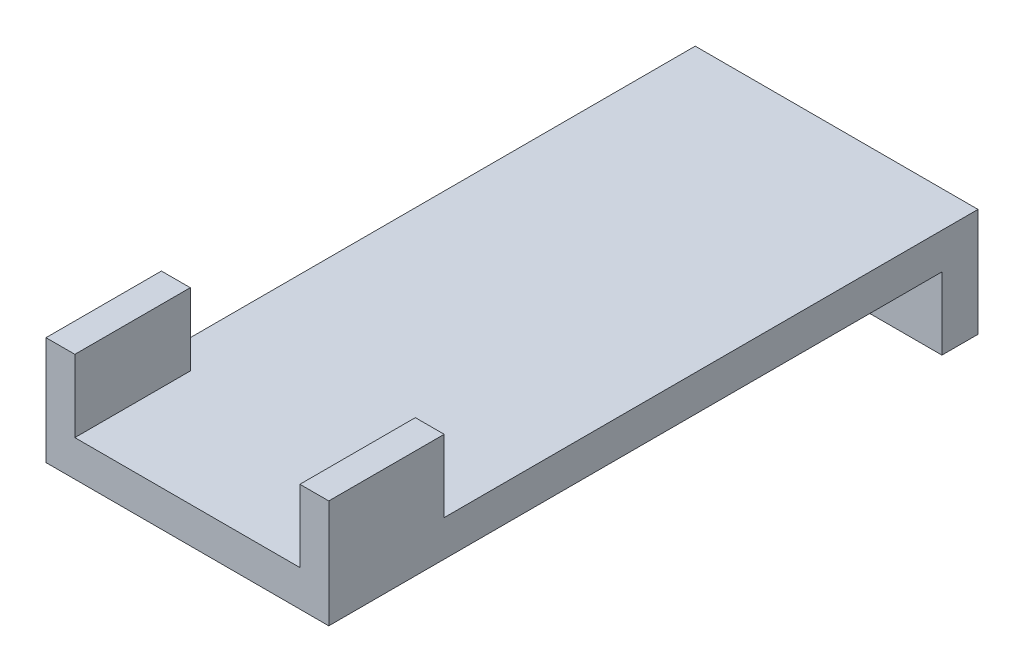
ISO-10303-21;
HEADER;
FILE_DESCRIPTION(('STEP AP214'),'2;1');
FILE_NAME('part.step','',(''),(''),'','','');
FILE_SCHEMA(('AUTOMOTIVE_DESIGN { 1 0 10303 214 1 1 1 1 }'));
ENDSEC;
DATA;
#1=APPLICATION_CONTEXT('core data for automotive mechanical design processes');
#2=APPLICATION_PROTOCOL_DEFINITION('international standard','automotive_design',2000,#1);
#3=PRODUCT_CONTEXT('',#1,'mechanical');
#4=PRODUCT('Part','Part','',(#3));
#5=PRODUCT_RELATED_PRODUCT_CATEGORY('part','',(#4));
#6=PRODUCT_DEFINITION_FORMATION('','',#4);
#7=PRODUCT_DEFINITION_CONTEXT('part definition',#1,'design');
#8=PRODUCT_DEFINITION('design','',#6,#7);
#9=PRODUCT_DEFINITION_SHAPE('','',#8);
#10=(LENGTH_UNIT() NAMED_UNIT(*) SI_UNIT(.MILLI.,.METRE.));
#11=(NAMED_UNIT(*) PLANE_ANGLE_UNIT() SI_UNIT($,.RADIAN.));
#12=(NAMED_UNIT(*) SI_UNIT($,.STERADIAN.) SOLID_ANGLE_UNIT());
#13=UNCERTAINTY_MEASURE_WITH_UNIT(LENGTH_MEASURE(1.E-05),#10,'distance_accuracy_value','');
#14=(GEOMETRIC_REPRESENTATION_CONTEXT(3) GLOBAL_UNCERTAINTY_ASSIGNED_CONTEXT((#13)) GLOBAL_UNIT_ASSIGNED_CONTEXT((#10,
#11,#12)) REPRESENTATION_CONTEXT('',''));
#15=CARTESIAN_POINT('',(0.,0.,0.));
#16=DIRECTION('',(0.,0.,1.));
#17=DIRECTION('',(1.,0.,0.));
#18=AXIS2_PLACEMENT_3D('',#15,#16,#17);
#19=CARTESIAN_POINT('',(0.,3.20985201149425,0.0218600574712643));
#20=DIRECTION('',(0.,-1.,0.));
#21=DIRECTION('',(0.,0.,-1.));
#22=AXIS2_PLACEMENT_3D('',#19,#20,#21);
#23=PLANE('',#22);
#24=DIRECTION('',(0.,0.,-1.));
#25=VECTOR('',#24,1.);
#26=CARTESIAN_POINT('',(-10.10412,3.20985201149425,29.1683600574713));
#27=LINE('',#26,#25);
#28=CARTESIAN_POINT('',(-10.10412,3.20985201149425,29.1683600574713));
#29=VERTEX_POINT('',#28);
#30=CARTESIAN_POINT('',(-10.10412,3.20985201149425,18.8051600574713));
#31=VERTEX_POINT('',#30);
#32=EDGE_CURVE('E149',#29,#31,#27,.T.);
#33=ORIENTED_EDGE('',*,*,#32,.F.);
#34=DIRECTION('',(1.,0.,0.));
#35=VECTOR('',#34,1.);
#36=CARTESIAN_POINT('',(-12.69492,3.20985201149425,29.1683600574713));
#37=LINE('',#36,#35);
#38=CARTESIAN_POINT('',(10.10412,3.20985201149425,29.1683600574713));
#39=VERTEX_POINT('',#38);
#40=EDGE_CURVE('E206',#29,#39,#37,.T.);
#41=ORIENTED_EDGE('',*,*,#40,.T.);
#42=DIRECTION('',(0.,0.,1.));
#43=VECTOR('',#42,1.);
#44=CARTESIAN_POINT('',(10.10412,3.20985201149425,29.1683600574713));
#45=LINE('',#44,#43);
#46=CARTESIAN_POINT('',(10.10412,3.20985201149425,18.8051600574713));
#47=VERTEX_POINT('',#46);
#48=EDGE_CURVE('E179',#47,#39,#45,.T.);
#49=ORIENTED_EDGE('',*,*,#48,.F.);
#50=DIRECTION('',(-1.,0.,0.));
#51=VECTOR('',#50,1.);
#52=CARTESIAN_POINT('',(12.69492,3.20985201149425,18.8051600574713));
#53=LINE('',#52,#51);
#54=CARTESIAN_POINT('',(12.69492,3.20985201149425,18.8051600574713));
#55=VERTEX_POINT('',#54);
#56=EDGE_CURVE('E174',#55,#47,#53,.T.);
#57=ORIENTED_EDGE('',*,*,#56,.F.);
#58=DIRECTION('',(0.,0.,-1.));
#59=VECTOR('',#58,1.);
#60=CARTESIAN_POINT('',(12.69492,3.20985201149425,29.1683600574713));
#61=LINE('',#60,#59);
#62=CARTESIAN_POINT('',(12.69492,3.20985201149425,-29.1246399425287));
#63=VERTEX_POINT('',#62);
#64=EDGE_CURVE('E199',#55,#63,#61,.T.);
#65=ORIENTED_EDGE('',*,*,#64,.T.);
#66=DIRECTION('',(-1.,0.,0.));
#67=VECTOR('',#66,1.);
#68=CARTESIAN_POINT('',(-12.69492,3.20985201149425,-29.1246399425287));
#69=LINE('',#68,#67);
#70=CARTESIAN_POINT('',(-12.69492,3.20985201149425,-29.1246399425287));
#71=VERTEX_POINT('',#70);
#72=EDGE_CURVE('E201',#63,#71,#69,.T.);
#73=ORIENTED_EDGE('',*,*,#72,.T.);
#74=DIRECTION('',(0.,0.,1.));
#75=VECTOR('',#74,1.);
#76=CARTESIAN_POINT('',(-12.69492,3.20985201149425,29.1683600574713));
#77=LINE('',#76,#75);
#78=CARTESIAN_POINT('',(-12.69492,3.20985201149425,18.8051600574713));
#79=VERTEX_POINT('',#78);
#80=EDGE_CURVE('E204',#71,#79,#77,.T.);
#81=ORIENTED_EDGE('',*,*,#80,.T.);
#82=DIRECTION('',(-1.,0.,0.));
#83=VECTOR('',#82,1.);
#84=CARTESIAN_POINT('',(-12.69492,3.20985201149425,18.8051600574713));
#85=LINE('',#84,#83);
#86=EDGE_CURVE('E59',#31,#79,#85,.T.);
#87=ORIENTED_EDGE('',*,*,#86,.F.);
#88=EDGE_LOOP('',(#33,#41,#49,#57,#65,#73,#81,#87));
#89=FACE_BOUND('',#88,.T.);
#90=ADVANCED_FACE('F36',(#89),#23,.F.);
#91=CARTESIAN_POINT('',(12.69492,3.20985201149425,29.1683600574713));
#92=DIRECTION('',(-1.,0.,0.));
#93=DIRECTION('',(0.,0.,1.));
#94=AXIS2_PLACEMENT_3D('',#91,#92,#93);
#95=PLANE('',#94);
#96=DIRECTION('',(0.,0.,-1.));
#97=VECTOR('',#96,1.);
#98=CARTESIAN_POINT('',(12.69492,-0.0286479885057471,29.1683600574713));
#99=LINE('',#98,#97);
#100=CARTESIAN_POINT('',(12.69492,-0.0286479885057471,29.1683600574713));
#101=VERTEX_POINT('',#100);
#102=CARTESIAN_POINT('',(12.69492,-0.0286479885057471,-25.8861399425287));
#103=VERTEX_POINT('',#102);
#104=EDGE_CURVE('E148',#101,#103,#99,.T.);
#105=ORIENTED_EDGE('',*,*,#104,.T.);
#106=DIRECTION('',(0.,1.,0.));
#107=VECTOR('',#106,1.);
#108=CARTESIAN_POINT('',(12.69492,-6.50564798850575,-25.8861399425287));
#109=LINE('',#108,#107);
#110=CARTESIAN_POINT('',(12.69492,-6.50564798850575,-25.8861399425287));
#111=VERTEX_POINT('',#110);
#112=EDGE_CURVE('E130',#111,#103,#109,.T.);
#113=ORIENTED_EDGE('',*,*,#112,.F.);
#114=DIRECTION('',(0.,0.,1.));
#115=VECTOR('',#114,1.);
#116=CARTESIAN_POINT('',(12.69492,-6.50564798850575,-29.1246399425287));
#117=LINE('',#116,#115);
#118=CARTESIAN_POINT('',(12.69492,-6.50564798850575,-29.1246399425287));
#119=VERTEX_POINT('',#118);
#120=EDGE_CURVE('E137',#119,#111,#117,.T.);
#121=ORIENTED_EDGE('',*,*,#120,.F.);
#122=DIRECTION('',(0.,-1.,0.));
#123=VECTOR('',#122,1.);
#124=CARTESIAN_POINT('',(12.69492,3.20985201149425,-29.1246399425287));
#125=LINE('',#124,#123);
#126=EDGE_CURVE('E11',#63,#119,#125,.T.);
#127=ORIENTED_EDGE('',*,*,#126,.F.);
#128=ORIENTED_EDGE('',*,*,#64,.F.);
#129=DIRECTION('',(0.,-1.,0.));
#130=VECTOR('',#129,1.);
#131=CARTESIAN_POINT('',(12.69492,9.68685201149425,18.8051600574713));
#132=LINE('',#131,#130);
#133=CARTESIAN_POINT('',(12.69492,9.68685201149425,18.8051600574713));
#134=VERTEX_POINT('',#133);
#135=EDGE_CURVE('E196',#134,#55,#132,.T.);
#136=ORIENTED_EDGE('',*,*,#135,.F.);
#137=DIRECTION('',(0.,0.,-1.));
#138=VECTOR('',#137,1.);
#139=CARTESIAN_POINT('',(12.69492,9.68685201149425,29.1683600574713));
#140=LINE('',#139,#138);
#141=CARTESIAN_POINT('',(12.69492,9.68685201149425,29.1683600574713));
#142=VERTEX_POINT('',#141);
#143=EDGE_CURVE('E175',#142,#134,#140,.T.);
#144=ORIENTED_EDGE('',*,*,#143,.F.);
#145=DIRECTION('',(0.,-1.,0.));
#146=VECTOR('',#145,1.);
#147=CARTESIAN_POINT('',(12.69492,3.20985201149425,29.1683600574713));
#148=LINE('',#147,#146);
#149=EDGE_CURVE('E208',#142,#101,#148,.T.);
#150=ORIENTED_EDGE('',*,*,#149,.T.);
#151=EDGE_LOOP('',(#105,#113,#121,#127,#128,#136,#144,#150));
#152=FACE_BOUND('',#151,.T.);
#153=ADVANCED_FACE('F38',(#152),#95,.F.);
#154=CARTESIAN_POINT('',(-12.69492,3.20985201149425,-29.1246399425287));
#155=DIRECTION('',(0.,0.,1.));
#156=DIRECTION('',(1.,0.,0.));
#157=AXIS2_PLACEMENT_3D('',#154,#155,#156);
#158=PLANE('',#157);
#159=ORIENTED_EDGE('',*,*,#126,.T.);
#160=DIRECTION('',(1.,0.,0.));
#161=VECTOR('',#160,1.);
#162=CARTESIAN_POINT('',(12.69492,-6.50564798850575,-29.1246399425287));
#163=LINE('',#162,#161);
#164=CARTESIAN_POINT('',(-12.69492,-6.50564798850575,-29.1246399425287));
#165=VERTEX_POINT('',#164);
#166=EDGE_CURVE('E143',#165,#119,#163,.T.);
#167=ORIENTED_EDGE('',*,*,#166,.F.);
#168=DIRECTION('',(0.,-1.,0.));
#169=VECTOR('',#168,1.);
#170=CARTESIAN_POINT('',(-12.69492,3.20985201149425,-29.1246399425287));
#171=LINE('',#170,#169);
#172=EDGE_CURVE('E44',#71,#165,#171,.T.);
#173=ORIENTED_EDGE('',*,*,#172,.F.);
#174=ORIENTED_EDGE('',*,*,#72,.F.);
#175=EDGE_LOOP('',(#159,#167,#173,#174));
#176=FACE_BOUND('',#175,.T.);
#177=ADVANCED_FACE('F223',(#176),#158,.F.);
#178=CARTESIAN_POINT('',(-12.69492,3.20985201149425,29.1683600574713));
#179=DIRECTION('',(1.,0.,0.));
#180=DIRECTION('',(0.,0.,-1.));
#181=AXIS2_PLACEMENT_3D('',#178,#179,#180);
#182=PLANE('',#181);
#183=ORIENTED_EDGE('',*,*,#172,.T.);
#184=DIRECTION('',(0.,0.,-1.));
#185=VECTOR('',#184,1.);
#186=CARTESIAN_POINT('',(-12.69492,-6.50564798850575,-29.1246399425287));
#187=LINE('',#186,#185);
#188=CARTESIAN_POINT('',(-12.69492,-6.50564798850575,-25.8861399425287));
#189=VERTEX_POINT('',#188);
#190=EDGE_CURVE('E136',#189,#165,#187,.T.);
#191=ORIENTED_EDGE('',*,*,#190,.F.);
#192=DIRECTION('',(0.,1.,0.));
#193=VECTOR('',#192,1.);
#194=CARTESIAN_POINT('',(-12.69492,-6.50564798850575,-25.8861399425287));
#195=LINE('',#194,#193);
#196=CARTESIAN_POINT('',(-12.69492,-0.0286479885057471,-25.8861399425287));
#197=VERTEX_POINT('',#196);
#198=EDGE_CURVE('E132',#189,#197,#195,.T.);
#199=ORIENTED_EDGE('',*,*,#198,.T.);
#200=DIRECTION('',(0.,0.,1.));
#201=VECTOR('',#200,1.);
#202=CARTESIAN_POINT('',(-12.69492,-0.0286479885057471,29.1683600574713));
#203=LINE('',#202,#201);
#204=CARTESIAN_POINT('',(-12.69492,-0.0286479885057471,29.1683600574713));
#205=VERTEX_POINT('',#204);
#206=EDGE_CURVE('E210',#197,#205,#203,.T.);
#207=ORIENTED_EDGE('',*,*,#206,.T.);
#208=DIRECTION('',(0.,-1.,0.));
#209=VECTOR('',#208,1.);
#210=CARTESIAN_POINT('',(-12.69492,3.20985201149425,29.1683600574713));
#211=LINE('',#210,#209);
#212=CARTESIAN_POINT('',(-12.69492,9.68685201149425,29.1683600574713));
#213=VERTEX_POINT('',#212);
#214=EDGE_CURVE('E214',#213,#205,#211,.T.);
#215=ORIENTED_EDGE('',*,*,#214,.F.);
#216=DIRECTION('',(0.,0.,1.));
#217=VECTOR('',#216,1.);
#218=CARTESIAN_POINT('',(-12.69492,9.68685201149425,29.1683600574713));
#219=LINE('',#218,#217);
#220=CARTESIAN_POINT('',(-12.69492,9.68685201149425,18.8051600574713));
#221=VERTEX_POINT('',#220);
#222=EDGE_CURVE('E155',#221,#213,#219,.T.);
#223=ORIENTED_EDGE('',*,*,#222,.F.);
#224=DIRECTION('',(0.,-1.,0.));
#225=VECTOR('',#224,1.);
#226=CARTESIAN_POINT('',(-12.69492,9.68685201149425,18.8051600574713));
#227=LINE('',#226,#225);
#228=EDGE_CURVE('E163',#221,#79,#227,.T.);
#229=ORIENTED_EDGE('',*,*,#228,.T.);
#230=ORIENTED_EDGE('',*,*,#80,.F.);
#231=EDGE_LOOP('',(#183,#191,#199,#207,#215,#223,#229,#230));
#232=FACE_BOUND('',#231,.T.);
#233=ADVANCED_FACE('F219',(#232),#182,.F.);
#234=CARTESIAN_POINT('',(-12.69492,3.20985201149425,29.1683600574713));
#235=DIRECTION('',(0.,0.,-1.));
#236=DIRECTION('',(-1.,0.,0.));
#237=AXIS2_PLACEMENT_3D('',#234,#235,#236);
#238=PLANE('',#237);
#239=DIRECTION('',(1.,0.,0.));
#240=VECTOR('',#239,1.);
#241=CARTESIAN_POINT('',(-12.69492,-0.0286479885057471,29.1683600574713));
#242=LINE('',#241,#240);
#243=EDGE_CURVE('E202',#205,#101,#242,.T.);
#244=ORIENTED_EDGE('',*,*,#243,.T.);
#245=ORIENTED_EDGE('',*,*,#149,.F.);
#246=DIRECTION('',(1.,0.,0.));
#247=VECTOR('',#246,1.);
#248=CARTESIAN_POINT('',(12.69492,9.68685201149425,29.1683600574713));
#249=LINE('',#248,#247);
#250=CARTESIAN_POINT('',(10.10412,9.68685201149425,29.1683600574713));
#251=VERTEX_POINT('',#250);
#252=EDGE_CURVE('E183',#251,#142,#249,.T.);
#253=ORIENTED_EDGE('',*,*,#252,.F.);
#254=DIRECTION('',(0.,-1.,0.));
#255=VECTOR('',#254,1.);
#256=CARTESIAN_POINT('',(10.10412,9.68685201149425,29.1683600574713));
#257=LINE('',#256,#255);
#258=EDGE_CURVE('E186',#251,#39,#257,.T.);
#259=ORIENTED_EDGE('',*,*,#258,.T.);
#260=ORIENTED_EDGE('',*,*,#40,.F.);
#261=DIRECTION('',(0.,-1.,0.));
#262=VECTOR('',#261,1.);
#263=CARTESIAN_POINT('',(-10.10412,9.68685201149425,29.1683600574713));
#264=LINE('',#263,#262);
#265=CARTESIAN_POINT('',(-10.10412,9.68685201149425,29.1683600574713));
#266=VERTEX_POINT('',#265);
#267=EDGE_CURVE('E171',#266,#29,#264,.T.);
#268=ORIENTED_EDGE('',*,*,#267,.F.);
#269=DIRECTION('',(1.,0.,0.));
#270=VECTOR('',#269,1.);
#271=CARTESIAN_POINT('',(-12.69492,9.68685201149425,29.1683600574713));
#272=LINE('',#271,#270);
#273=EDGE_CURVE('E158',#213,#266,#272,.T.);
#274=ORIENTED_EDGE('',*,*,#273,.F.);
#275=ORIENTED_EDGE('',*,*,#214,.T.);
#276=EDGE_LOOP('',(#244,#245,#253,#259,#260,#268,#274,#275));
#277=FACE_BOUND('',#276,.T.);
#278=ADVANCED_FACE('F229',(#277),#238,.F.);
#279=CARTESIAN_POINT('',(0.,-0.0286479885057471,0.0218600574712643));
#280=DIRECTION('',(0.,-1.,0.));
#281=DIRECTION('',(0.,0.,-1.));
#282=AXIS2_PLACEMENT_3D('',#279,#280,#281);
#283=PLANE('',#282);
#284=DIRECTION('',(-1.,0.,0.));
#285=VECTOR('',#284,1.);
#286=CARTESIAN_POINT('',(12.69492,-0.0286479885057471,-25.8861399425287));
#287=LINE('',#286,#285);
#288=EDGE_CURVE('E51',#103,#197,#287,.T.);
#289=ORIENTED_EDGE('',*,*,#288,.F.);
#290=ORIENTED_EDGE('',*,*,#104,.F.);
#291=ORIENTED_EDGE('',*,*,#243,.F.);
#292=ORIENTED_EDGE('',*,*,#206,.F.);
#293=EDGE_LOOP('',(#289,#290,#291,#292));
#294=FACE_BOUND('',#293,.T.);
#295=ADVANCED_FACE('F231',(#294),#283,.T.);
#296=CARTESIAN_POINT('',(12.69492,9.68685201149425,18.8051600574713));
#297=DIRECTION('',(0.,0.,1.));
#298=DIRECTION('',(1.,0.,0.));
#299=AXIS2_PLACEMENT_3D('',#296,#297,#298);
#300=PLANE('',#299);
#301=ORIENTED_EDGE('',*,*,#56,.T.);
#302=DIRECTION('',(0.,-1.,0.));
#303=VECTOR('',#302,1.);
#304=CARTESIAN_POINT('',(10.10412,9.68685201149425,18.8051600574713));
#305=LINE('',#304,#303);
#306=CARTESIAN_POINT('',(10.10412,9.68685201149425,18.8051600574713));
#307=VERTEX_POINT('',#306);
#308=EDGE_CURVE('E193',#307,#47,#305,.T.);
#309=ORIENTED_EDGE('',*,*,#308,.F.);
#310=DIRECTION('',(-1.,0.,0.));
#311=VECTOR('',#310,1.);
#312=CARTESIAN_POINT('',(12.69492,9.68685201149425,18.8051600574713));
#313=LINE('',#312,#311);
#314=EDGE_CURVE('E178',#134,#307,#313,.T.);
#315=ORIENTED_EDGE('',*,*,#314,.F.);
#316=ORIENTED_EDGE('',*,*,#135,.T.);
#317=EDGE_LOOP('',(#301,#309,#315,#316));
#318=FACE_BOUND('',#317,.T.);
#319=ADVANCED_FACE('F233',(#318),#300,.F.);
#320=CARTESIAN_POINT('',(10.10412,9.68685201149425,29.1683600574713));
#321=DIRECTION('',(1.,0.,0.));
#322=DIRECTION('',(0.,0.,-1.));
#323=AXIS2_PLACEMENT_3D('',#320,#321,#322);
#324=PLANE('',#323);
#325=ORIENTED_EDGE('',*,*,#48,.T.);
#326=ORIENTED_EDGE('',*,*,#258,.F.);
#327=DIRECTION('',(0.,0.,1.));
#328=VECTOR('',#327,1.);
#329=CARTESIAN_POINT('',(10.10412,9.68685201149425,29.1683600574713));
#330=LINE('',#329,#328);
#331=EDGE_CURVE('E181',#307,#251,#330,.T.);
#332=ORIENTED_EDGE('',*,*,#331,.F.);
#333=ORIENTED_EDGE('',*,*,#308,.T.);
#334=EDGE_LOOP('',(#325,#326,#332,#333));
#335=FACE_BOUND('',#334,.T.);
#336=ADVANCED_FACE('F239',(#335),#324,.F.);
#337=CARTESIAN_POINT('',(0.,9.68685201149425,0.0218600574712643));
#338=DIRECTION('',(0.,1.,0.));
#339=DIRECTION('',(0.,0.,1.));
#340=AXIS2_PLACEMENT_3D('',#337,#338,#339);
#341=PLANE('',#340);
#342=ORIENTED_EDGE('',*,*,#143,.T.);
#343=ORIENTED_EDGE('',*,*,#314,.T.);
#344=ORIENTED_EDGE('',*,*,#331,.T.);
#345=ORIENTED_EDGE('',*,*,#252,.T.);
#346=EDGE_LOOP('',(#342,#343,#344,#345));
#347=FACE_BOUND('',#346,.T.);
#348=ADVANCED_FACE('F251',(#347),#341,.T.);
#349=CARTESIAN_POINT('',(-10.10412,9.68685201149425,29.1683600574713));
#350=DIRECTION('',(-1.,0.,0.));
#351=DIRECTION('',(0.,0.,1.));
#352=AXIS2_PLACEMENT_3D('',#349,#350,#351);
#353=PLANE('',#352);
#354=ORIENTED_EDGE('',*,*,#32,.T.);
#355=DIRECTION('',(0.,-1.,0.));
#356=VECTOR('',#355,1.);
#357=CARTESIAN_POINT('',(-10.10412,9.68685201149425,18.8051600574713));
#358=LINE('',#357,#356);
#359=CARTESIAN_POINT('',(-10.10412,9.68685201149425,18.8051600574713));
#360=VERTEX_POINT('',#359);
#361=EDGE_CURVE('E168',#360,#31,#358,.T.);
#362=ORIENTED_EDGE('',*,*,#361,.F.);
#363=DIRECTION('',(0.,0.,-1.));
#364=VECTOR('',#363,1.);
#365=CARTESIAN_POINT('',(-10.10412,9.68685201149425,29.1683600574713));
#366=LINE('',#365,#364);
#367=EDGE_CURVE('E160',#266,#360,#366,.T.);
#368=ORIENTED_EDGE('',*,*,#367,.F.);
#369=ORIENTED_EDGE('',*,*,#267,.T.);
#370=EDGE_LOOP('',(#354,#362,#368,#369));
#371=FACE_BOUND('',#370,.T.);
#372=ADVANCED_FACE('F255',(#371),#353,.F.);
#373=CARTESIAN_POINT('',(-12.69492,9.68685201149425,18.8051600574713));
#374=DIRECTION('',(0.,0.,1.));
#375=DIRECTION('',(1.,0.,0.));
#376=AXIS2_PLACEMENT_3D('',#373,#374,#375);
#377=PLANE('',#376);
#378=ORIENTED_EDGE('',*,*,#86,.T.);
#379=ORIENTED_EDGE('',*,*,#228,.F.);
#380=DIRECTION('',(-1.,0.,0.));
#381=VECTOR('',#380,1.);
#382=CARTESIAN_POINT('',(-12.69492,9.68685201149425,18.8051600574713));
#383=LINE('',#382,#381);
#384=EDGE_CURVE('E162',#360,#221,#383,.T.);
#385=ORIENTED_EDGE('',*,*,#384,.F.);
#386=ORIENTED_EDGE('',*,*,#361,.T.);
#387=EDGE_LOOP('',(#378,#379,#385,#386));
#388=FACE_BOUND('',#387,.T.);
#389=ADVANCED_FACE('F259',(#388),#377,.F.);
#390=CARTESIAN_POINT('',(0.,9.68685201149425,0.0218600574712643));
#391=DIRECTION('',(0.,-1.,0.));
#392=DIRECTION('',(0.,0.,-1.));
#393=AXIS2_PLACEMENT_3D('',#390,#391,#392);
#394=PLANE('',#393);
#395=ORIENTED_EDGE('',*,*,#222,.T.);
#396=ORIENTED_EDGE('',*,*,#273,.T.);
#397=ORIENTED_EDGE('',*,*,#367,.T.);
#398=ORIENTED_EDGE('',*,*,#384,.T.);
#399=EDGE_LOOP('',(#395,#396,#397,#398));
#400=FACE_BOUND('',#399,.T.);
#401=ADVANCED_FACE('F263',(#400),#394,.F.);
#402=CARTESIAN_POINT('',(12.69492,-6.50564798850575,-25.8861399425287));
#403=DIRECTION('',(0.,0.,-1.));
#404=DIRECTION('',(-1.,0.,0.));
#405=AXIS2_PLACEMENT_3D('',#402,#403,#404);
#406=PLANE('',#405);
#407=ORIENTED_EDGE('',*,*,#288,.T.);
#408=ORIENTED_EDGE('',*,*,#198,.F.);
#409=DIRECTION('',(-1.,0.,0.));
#410=VECTOR('',#409,1.);
#411=CARTESIAN_POINT('',(12.69492,-6.50564798850575,-25.8861399425287));
#412=LINE('',#411,#410);
#413=EDGE_CURVE('E126',#111,#189,#412,.T.);
#414=ORIENTED_EDGE('',*,*,#413,.F.);
#415=ORIENTED_EDGE('',*,*,#112,.T.);
#416=EDGE_LOOP('',(#407,#408,#414,#415));
#417=FACE_BOUND('',#416,.T.);
#418=ADVANCED_FACE('F128',(#417),#406,.F.);
#419=CARTESIAN_POINT('',(0.,-6.50564798850575,0.0218600574712643));
#420=DIRECTION('',(0.,-1.,0.));
#421=DIRECTION('',(0.,0.,-1.));
#422=AXIS2_PLACEMENT_3D('',#419,#420,#421);
#423=PLANE('',#422);
#424=ORIENTED_EDGE('',*,*,#120,.T.);
#425=ORIENTED_EDGE('',*,*,#413,.T.);
#426=ORIENTED_EDGE('',*,*,#190,.T.);
#427=ORIENTED_EDGE('',*,*,#166,.T.);
#428=EDGE_LOOP('',(#424,#425,#426,#427));
#429=FACE_BOUND('',#428,.T.);
#430=ADVANCED_FACE('F141',(#429),#423,.T.);
#431=CLOSED_SHELL('',(#90,#153,#177,#233,#278,#295,#319,#336,#348,#372,#389,#401,#418,#430));
#432=MANIFOLD_SOLID_BREP('B2',#431);
#433=ADVANCED_BREP_SHAPE_REPRESENTATION('',(#18,#432),#14);
#434=SHAPE_DEFINITION_REPRESENTATION(#9,#433);
ENDSEC;
END-ISO-10303-21;
